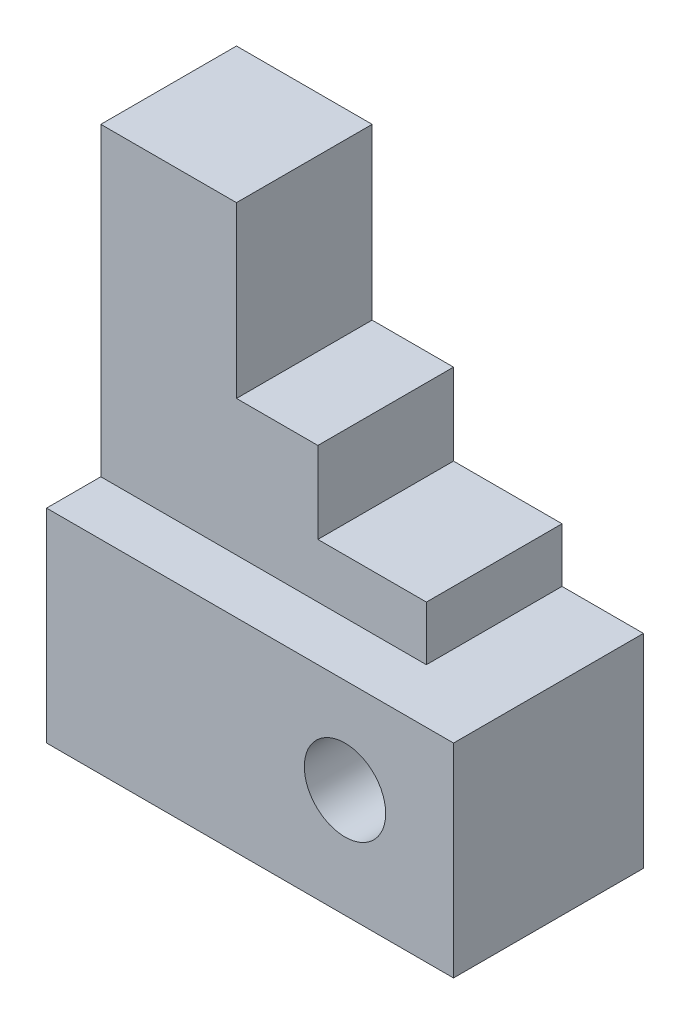
ISO-10303-21;
HEADER;
FILE_DESCRIPTION(('STEP AP214'),'2;1');
FILE_NAME('part.step','',(''),(''),'','','');
FILE_SCHEMA(('AUTOMOTIVE_DESIGN { 1 0 10303 214 1 1 1 1 }'));
ENDSEC;
DATA;
#1=APPLICATION_CONTEXT('core data for automotive mechanical design processes');
#2=APPLICATION_PROTOCOL_DEFINITION('international standard','automotive_design',2000,#1);
#3=PRODUCT_CONTEXT('',#1,'mechanical');
#4=PRODUCT('Part','Part','',(#3));
#5=PRODUCT_RELATED_PRODUCT_CATEGORY('part','',(#4));
#6=PRODUCT_DEFINITION_FORMATION('','',#4);
#7=PRODUCT_DEFINITION_CONTEXT('part definition',#1,'design');
#8=PRODUCT_DEFINITION('design','',#6,#7);
#9=PRODUCT_DEFINITION_SHAPE('','',#8);
#10=(LENGTH_UNIT() NAMED_UNIT(*) SI_UNIT(.MILLI.,.METRE.));
#11=(NAMED_UNIT(*) PLANE_ANGLE_UNIT() SI_UNIT($,.RADIAN.));
#12=(NAMED_UNIT(*) SI_UNIT($,.STERADIAN.) SOLID_ANGLE_UNIT());
#13=UNCERTAINTY_MEASURE_WITH_UNIT(LENGTH_MEASURE(1.E-05),#10,'distance_accuracy_value','');
#14=(GEOMETRIC_REPRESENTATION_CONTEXT(3) GLOBAL_UNCERTAINTY_ASSIGNED_CONTEXT((#13)) GLOBAL_UNIT_ASSIGNED_CONTEXT((#10,
#11,#12)) REPRESENTATION_CONTEXT('',''));
#15=CARTESIAN_POINT('',(0.,0.,0.));
#16=DIRECTION('',(0.,0.,1.));
#17=DIRECTION('',(1.,0.,0.));
#18=AXIS2_PLACEMENT_3D('',#15,#16,#17);
#19=CARTESIAN_POINT('',(0.,15.,28.));
#20=DIRECTION('',(0.,-1.,0.));
#21=DIRECTION('',(1.,0.,0.));
#22=AXIS2_PLACEMENT_3D('',#19,#20,#21);
#23=PLANE('',#22);
#24=DIRECTION('',(0.,0.,-1.));
#25=VECTOR('',#24,1.);
#26=CARTESIAN_POINT('',(18.,15.,20.));
#27=LINE('',#26,#25);
#28=CARTESIAN_POINT('',(18.,15.,20.));
#29=VERTEX_POINT('',#28);
#30=CARTESIAN_POINT('',(18.,15.,0.));
#31=VERTEX_POINT('',#30);
#32=EDGE_CURVE('E125',#29,#31,#27,.T.);
#33=ORIENTED_EDGE('',*,*,#32,.F.);
#34=DIRECTION('',(1.,0.,0.));
#35=VECTOR('',#34,1.);
#36=CARTESIAN_POINT('',(0.,15.,20.));
#37=LINE('',#36,#35);
#38=CARTESIAN_POINT('',(-30.,15.,20.));
#39=VERTEX_POINT('',#38);
#40=EDGE_CURVE('E61',#39,#29,#37,.T.);
#41=ORIENTED_EDGE('',*,*,#40,.F.);
#42=DIRECTION('',(0.,0.,-1.));
#43=VECTOR('',#42,1.);
#44=CARTESIAN_POINT('',(-30.,15.,28.));
#45=LINE('',#44,#43);
#46=CARTESIAN_POINT('',(-30.,15.,28.));
#47=VERTEX_POINT('',#46);
#48=EDGE_CURVE('E229',#47,#39,#45,.T.);
#49=ORIENTED_EDGE('',*,*,#48,.F.);
#50=DIRECTION('',(-1.,0.,0.));
#51=VECTOR('',#50,1.);
#52=CARTESIAN_POINT('',(0.,15.,28.));
#53=LINE('',#52,#51);
#54=CARTESIAN_POINT('',(30.,15.,28.));
#55=VERTEX_POINT('',#54);
#56=EDGE_CURVE('E226',#55,#47,#53,.T.);
#57=ORIENTED_EDGE('',*,*,#56,.F.);
#58=DIRECTION('',(0.,0.,-1.));
#59=VECTOR('',#58,1.);
#60=CARTESIAN_POINT('',(30.,15.,28.));
#61=LINE('',#60,#59);
#62=CARTESIAN_POINT('',(30.,15.,0.));
#63=VERTEX_POINT('',#62);
#64=EDGE_CURVE('E248',#55,#63,#61,.T.);
#65=ORIENTED_EDGE('',*,*,#64,.T.);
#66=DIRECTION('',(-1.,0.,0.));
#67=VECTOR('',#66,1.);
#68=CARTESIAN_POINT('',(0.,15.,0.));
#69=LINE('',#68,#67);
#70=EDGE_CURVE('E67',#63,#31,#69,.T.);
#71=ORIENTED_EDGE('',*,*,#70,.T.);
#72=EDGE_LOOP('',(#33,#41,#49,#57,#65,#71));
#73=FACE_BOUND('',#72,.T.);
#74=ADVANCED_FACE('F45',(#73),#23,.F.);
#75=CARTESIAN_POINT('',(-30.,0.,28.));
#76=DIRECTION('',(-1.,0.,0.));
#77=DIRECTION('',(0.,0.,1.));
#78=AXIS2_PLACEMENT_3D('',#75,#76,#77);
#79=PLANE('',#78);
#80=DIRECTION('',(0.,1.,0.));
#81=VECTOR('',#80,1.);
#82=CARTESIAN_POINT('',(-30.,0.,0.));
#83=LINE('',#82,#81);
#84=CARTESIAN_POINT('',(-30.,-15.,0.));
#85=VERTEX_POINT('',#84);
#86=CARTESIAN_POINT('',(-30.,60.,0.));
#87=VERTEX_POINT('',#86);
#88=EDGE_CURVE('E233',#85,#87,#83,.T.);
#89=ORIENTED_EDGE('',*,*,#88,.F.);
#90=DIRECTION('',(0.,0.,-1.));
#91=VECTOR('',#90,1.);
#92=CARTESIAN_POINT('',(-30.,-15.,28.));
#93=LINE('',#92,#91);
#94=CARTESIAN_POINT('',(-30.,-15.,28.));
#95=VERTEX_POINT('',#94);
#96=EDGE_CURVE('E11',#95,#85,#93,.T.);
#97=ORIENTED_EDGE('',*,*,#96,.F.);
#98=DIRECTION('',(0.,1.,0.));
#99=VECTOR('',#98,1.);
#100=CARTESIAN_POINT('',(-30.,0.,28.));
#101=LINE('',#100,#99);
#102=EDGE_CURVE('E214',#95,#47,#101,.T.);
#103=ORIENTED_EDGE('',*,*,#102,.T.);
#104=ORIENTED_EDGE('',*,*,#48,.T.);
#105=DIRECTION('',(0.,1.,0.));
#106=VECTOR('',#105,1.);
#107=CARTESIAN_POINT('',(-30.,0.,20.));
#108=LINE('',#107,#106);
#109=CARTESIAN_POINT('',(-30.,60.,20.));
#110=VERTEX_POINT('',#109);
#111=EDGE_CURVE('E142',#39,#110,#108,.T.);
#112=ORIENTED_EDGE('',*,*,#111,.T.);
#113=DIRECTION('',(0.,0.,-1.));
#114=VECTOR('',#113,1.);
#115=CARTESIAN_POINT('',(-30.,60.,20.));
#116=LINE('',#115,#114);
#117=EDGE_CURVE('E131',#110,#87,#116,.T.);
#118=ORIENTED_EDGE('',*,*,#117,.T.);
#119=EDGE_LOOP('',(#89,#97,#103,#104,#112,#118));
#120=FACE_BOUND('',#119,.T.);
#121=ADVANCED_FACE('F265',(#120),#79,.T.);
#122=CARTESIAN_POINT('',(0.,-15.,28.));
#123=DIRECTION('',(0.,-1.,0.));
#124=DIRECTION('',(1.,0.,0.));
#125=AXIS2_PLACEMENT_3D('',#122,#123,#124);
#126=PLANE('',#125);
#127=DIRECTION('',(-1.,0.,0.));
#128=VECTOR('',#127,1.);
#129=CARTESIAN_POINT('',(0.,-15.,0.));
#130=LINE('',#129,#128);
#131=CARTESIAN_POINT('',(30.,-15.,0.));
#132=VERTEX_POINT('',#131);
#133=EDGE_CURVE('E236',#132,#85,#130,.T.);
#134=ORIENTED_EDGE('',*,*,#133,.F.);
#135=DIRECTION('',(0.,0.,-1.));
#136=VECTOR('',#135,1.);
#137=CARTESIAN_POINT('',(30.,-15.,28.));
#138=LINE('',#137,#136);
#139=CARTESIAN_POINT('',(30.,-15.,28.));
#140=VERTEX_POINT('',#139);
#141=EDGE_CURVE('E54',#140,#132,#138,.T.);
#142=ORIENTED_EDGE('',*,*,#141,.F.);
#143=DIRECTION('',(-1.,0.,0.));
#144=VECTOR('',#143,1.);
#145=CARTESIAN_POINT('',(0.,-15.,28.));
#146=LINE('',#145,#144);
#147=EDGE_CURVE('E218',#140,#95,#146,.T.);
#148=ORIENTED_EDGE('',*,*,#147,.T.);
#149=ORIENTED_EDGE('',*,*,#96,.T.);
#150=EDGE_LOOP('',(#134,#142,#148,#149));
#151=FACE_BOUND('',#150,.T.);
#152=ADVANCED_FACE('F261',(#151),#126,.T.);
#153=CARTESIAN_POINT('',(30.,0.,28.));
#154=DIRECTION('',(-1.,0.,0.));
#155=DIRECTION('',(0.,-1.,0.));
#156=AXIS2_PLACEMENT_3D('',#153,#154,#155);
#157=PLANE('',#156);
#158=DIRECTION('',(0.,1.,0.));
#159=VECTOR('',#158,1.);
#160=CARTESIAN_POINT('',(30.,0.,0.));
#161=LINE('',#160,#159);
#162=EDGE_CURVE('E240',#132,#63,#161,.T.);
#163=ORIENTED_EDGE('',*,*,#162,.T.);
#164=ORIENTED_EDGE('',*,*,#64,.F.);
#165=DIRECTION('',(0.,1.,0.));
#166=VECTOR('',#165,1.);
#167=CARTESIAN_POINT('',(30.,0.,28.));
#168=LINE('',#167,#166);
#169=EDGE_CURVE('E222',#140,#55,#168,.T.);
#170=ORIENTED_EDGE('',*,*,#169,.F.);
#171=ORIENTED_EDGE('',*,*,#141,.T.);
#172=EDGE_LOOP('',(#163,#164,#170,#171));
#173=FACE_BOUND('',#172,.T.);
#174=ADVANCED_FACE('F254',(#173),#157,.F.);
#175=CARTESIAN_POINT('',(14.,1.,28.));
#176=DIRECTION('',(0.,0.,-1.));
#177=DIRECTION('',(-1.,0.,0.));
#178=AXIS2_PLACEMENT_3D('',#175,#176,#177);
#179=CYLINDRICAL_SURFACE('',#178,6.);
#180=CARTESIAN_POINT('',(14.,1.,28.));
#181=DIRECTION('',(0.,0.,1.));
#182=DIRECTION('',(1.,0.,0.));
#183=AXIS2_PLACEMENT_3D('',#180,#181,#182);
#184=CIRCLE('',#183,6.);
#185=CARTESIAN_POINT('',(20.,1.,28.));
#186=VERTEX_POINT('',#185);
#187=EDGE_CURVE('E210',#186,#186,#184,.T.);
#188=ORIENTED_EDGE('',*,*,#187,.T.);
#189=EDGE_LOOP('',(#188));
#190=FACE_BOUND('',#189,.T.);
#191=CARTESIAN_POINT('',(14.,1.,0.));
#192=DIRECTION('',(0.,0.,1.));
#193=DIRECTION('',(1.,0.,0.));
#194=AXIS2_PLACEMENT_3D('',#191,#192,#193);
#195=CIRCLE('',#194,6.);
#196=CARTESIAN_POINT('',(20.,1.,0.));
#197=VERTEX_POINT('',#196);
#198=EDGE_CURVE('E194',#197,#197,#195,.T.);
#199=ORIENTED_EDGE('',*,*,#198,.F.);
#200=EDGE_LOOP('',(#199));
#201=FACE_BOUND('',#200,.T.);
#202=ADVANCED_FACE('F47',(#190,#201),#179,.F.);
#203=CARTESIAN_POINT('',(0.,0.,28.));
#204=DIRECTION('',(0.,0.,1.));
#205=DIRECTION('',(1.,0.,0.));
#206=AXIS2_PLACEMENT_3D('',#203,#204,#205);
#207=PLANE('',#206);
#208=ORIENTED_EDGE('',*,*,#187,.F.);
#209=EDGE_LOOP('',(#208));
#210=FACE_BOUND('',#209,.T.);
#211=ORIENTED_EDGE('',*,*,#102,.F.);
#212=ORIENTED_EDGE('',*,*,#147,.F.);
#213=ORIENTED_EDGE('',*,*,#169,.T.);
#214=ORIENTED_EDGE('',*,*,#56,.T.);
#215=EDGE_LOOP('',(#211,#212,#213,#214));
#216=FACE_BOUND('',#215,.T.);
#217=ADVANCED_FACE('F319',(#210,#216),#207,.T.);
#218=CARTESIAN_POINT('',(0.,0.,0.));
#219=DIRECTION('',(0.,0.,1.));
#220=DIRECTION('',(1.,0.,0.));
#221=AXIS2_PLACEMENT_3D('',#218,#219,#220);
#222=PLANE('',#221);
#223=ORIENTED_EDGE('',*,*,#198,.T.);
#224=EDGE_LOOP('',(#223));
#225=FACE_BOUND('',#224,.T.);
#226=ORIENTED_EDGE('',*,*,#88,.T.);
#227=DIRECTION('',(1.,0.,0.));
#228=VECTOR('',#227,1.);
#229=CARTESIAN_POINT('',(0.,60.,0.));
#230=LINE('',#229,#228);
#231=CARTESIAN_POINT('',(-9.99999999999999,60.,0.));
#232=VERTEX_POINT('',#231);
#233=EDGE_CURVE('E177',#87,#232,#230,.T.);
#234=ORIENTED_EDGE('',*,*,#233,.T.);
#235=DIRECTION('',(0.,1.,0.));
#236=VECTOR('',#235,1.);
#237=CARTESIAN_POINT('',(-9.99999999999999,0.,0.));
#238=LINE('',#237,#236);
#239=CARTESIAN_POINT('',(-9.99999999999999,35.,0.));
#240=VERTEX_POINT('',#239);
#241=EDGE_CURVE('E181',#240,#232,#238,.T.);
#242=ORIENTED_EDGE('',*,*,#241,.F.);
#243=DIRECTION('',(1.,0.,0.));
#244=VECTOR('',#243,1.);
#245=CARTESIAN_POINT('',(0.,35.,0.));
#246=LINE('',#245,#244);
#247=CARTESIAN_POINT('',(2.00000000000001,35.,0.));
#248=VERTEX_POINT('',#247);
#249=EDGE_CURVE('E185',#240,#248,#246,.T.);
#250=ORIENTED_EDGE('',*,*,#249,.T.);
#251=DIRECTION('',(0.,1.,0.));
#252=VECTOR('',#251,1.);
#253=CARTESIAN_POINT('',(2.00000000000001,0.,0.));
#254=LINE('',#253,#252);
#255=CARTESIAN_POINT('',(2.00000000000001,23.,0.));
#256=VERTEX_POINT('',#255);
#257=EDGE_CURVE('E153',#256,#248,#254,.T.);
#258=ORIENTED_EDGE('',*,*,#257,.F.);
#259=DIRECTION('',(1.,0.,0.));
#260=VECTOR('',#259,1.);
#261=CARTESIAN_POINT('',(0.,23.,0.));
#262=LINE('',#261,#260);
#263=CARTESIAN_POINT('',(18.,23.,0.));
#264=VERTEX_POINT('',#263);
#265=EDGE_CURVE('E149',#256,#264,#262,.T.);
#266=ORIENTED_EDGE('',*,*,#265,.T.);
#267=DIRECTION('',(0.,1.,0.));
#268=VECTOR('',#267,1.);
#269=CARTESIAN_POINT('',(18.,0.,0.));
#270=LINE('',#269,#268);
#271=EDGE_CURVE('E174',#31,#264,#270,.T.);
#272=ORIENTED_EDGE('',*,*,#271,.F.);
#273=ORIENTED_EDGE('',*,*,#70,.F.);
#274=ORIENTED_EDGE('',*,*,#162,.F.);
#275=ORIENTED_EDGE('',*,*,#133,.T.);
#276=EDGE_LOOP('',(#226,#234,#242,#250,#258,#266,#272,#273,#274,#275));
#277=FACE_BOUND('',#276,.T.);
#278=ADVANCED_FACE('F260',(#225,#277),#222,.F.);
#279=CARTESIAN_POINT('',(18.,0.,20.));
#280=DIRECTION('',(-1.,0.,0.));
#281=DIRECTION('',(0.,0.,1.));
#282=AXIS2_PLACEMENT_3D('',#279,#280,#281);
#283=PLANE('',#282);
#284=ORIENTED_EDGE('',*,*,#271,.T.);
#285=DIRECTION('',(0.,0.,-1.));
#286=VECTOR('',#285,1.);
#287=CARTESIAN_POINT('',(18.,23.,20.));
#288=LINE('',#287,#286);
#289=CARTESIAN_POINT('',(18.,23.,20.));
#290=VERTEX_POINT('',#289);
#291=EDGE_CURVE('E146',#290,#264,#288,.T.);
#292=ORIENTED_EDGE('',*,*,#291,.F.);
#293=DIRECTION('',(0.,1.,0.));
#294=VECTOR('',#293,1.);
#295=CARTESIAN_POINT('',(18.,0.,20.));
#296=LINE('',#295,#294);
#297=EDGE_CURVE('E138',#29,#290,#296,.T.);
#298=ORIENTED_EDGE('',*,*,#297,.F.);
#299=ORIENTED_EDGE('',*,*,#32,.T.);
#300=EDGE_LOOP('',(#284,#292,#298,#299));
#301=FACE_BOUND('',#300,.T.);
#302=ADVANCED_FACE('F145',(#301),#283,.F.);
#303=CARTESIAN_POINT('',(0.,23.,20.));
#304=DIRECTION('',(0.,1.,0.));
#305=DIRECTION('',(-1.,0.,0.));
#306=AXIS2_PLACEMENT_3D('',#303,#304,#305);
#307=PLANE('',#306);
#308=ORIENTED_EDGE('',*,*,#265,.F.);
#309=DIRECTION('',(0.,0.,-1.));
#310=VECTOR('',#309,1.);
#311=CARTESIAN_POINT('',(2.00000000000001,23.,20.));
#312=LINE('',#311,#310);
#313=CARTESIAN_POINT('',(2.00000000000001,23.,20.));
#314=VERTEX_POINT('',#313);
#315=EDGE_CURVE('E195',#314,#256,#312,.T.);
#316=ORIENTED_EDGE('',*,*,#315,.F.);
#317=DIRECTION('',(1.,0.,0.));
#318=VECTOR('',#317,1.);
#319=CARTESIAN_POINT('',(0.,23.,20.));
#320=LINE('',#319,#318);
#321=EDGE_CURVE('E132',#314,#290,#320,.T.);
#322=ORIENTED_EDGE('',*,*,#321,.T.);
#323=ORIENTED_EDGE('',*,*,#291,.T.);
#324=EDGE_LOOP('',(#308,#316,#322,#323));
#325=FACE_BOUND('',#324,.T.);
#326=ADVANCED_FACE('F283',(#325),#307,.T.);
#327=CARTESIAN_POINT('',(2.00000000000001,0.,20.));
#328=DIRECTION('',(-1.,0.,0.));
#329=DIRECTION('',(0.,0.,1.));
#330=AXIS2_PLACEMENT_3D('',#327,#328,#329);
#331=PLANE('',#330);
#332=ORIENTED_EDGE('',*,*,#257,.T.);
#333=DIRECTION('',(0.,0.,-1.));
#334=VECTOR('',#333,1.);
#335=CARTESIAN_POINT('',(2.00000000000001,35.,20.));
#336=LINE('',#335,#334);
#337=CARTESIAN_POINT('',(2.00000000000001,35.,20.));
#338=VERTEX_POINT('',#337);
#339=EDGE_CURVE('E198',#338,#248,#336,.T.);
#340=ORIENTED_EDGE('',*,*,#339,.F.);
#341=DIRECTION('',(0.,1.,0.));
#342=VECTOR('',#341,1.);
#343=CARTESIAN_POINT('',(2.00000000000001,0.,20.));
#344=LINE('',#343,#342);
#345=EDGE_CURVE('E169',#314,#338,#344,.T.);
#346=ORIENTED_EDGE('',*,*,#345,.F.);
#347=ORIENTED_EDGE('',*,*,#315,.T.);
#348=EDGE_LOOP('',(#332,#340,#346,#347));
#349=FACE_BOUND('',#348,.T.);
#350=ADVANCED_FACE('F285',(#349),#331,.F.);
#351=CARTESIAN_POINT('',(0.,35.,20.));
#352=DIRECTION('',(0.,1.,0.));
#353=DIRECTION('',(0.,0.,1.));
#354=AXIS2_PLACEMENT_3D('',#351,#352,#353);
#355=PLANE('',#354);
#356=ORIENTED_EDGE('',*,*,#249,.F.);
#357=DIRECTION('',(0.,0.,-1.));
#358=VECTOR('',#357,1.);
#359=CARTESIAN_POINT('',(-9.99999999999999,35.,20.));
#360=LINE('',#359,#358);
#361=CARTESIAN_POINT('',(-9.99999999999999,35.,20.));
#362=VERTEX_POINT('',#361);
#363=EDGE_CURVE('E201',#362,#240,#360,.T.);
#364=ORIENTED_EDGE('',*,*,#363,.F.);
#365=DIRECTION('',(1.,0.,0.));
#366=VECTOR('',#365,1.);
#367=CARTESIAN_POINT('',(0.,35.,20.));
#368=LINE('',#367,#366);
#369=EDGE_CURVE('E165',#362,#338,#368,.T.);
#370=ORIENTED_EDGE('',*,*,#369,.T.);
#371=ORIENTED_EDGE('',*,*,#339,.T.);
#372=EDGE_LOOP('',(#356,#364,#370,#371));
#373=FACE_BOUND('',#372,.T.);
#374=ADVANCED_FACE('F277',(#373),#355,.T.);
#375=CARTESIAN_POINT('',(-9.99999999999999,0.,20.));
#376=DIRECTION('',(-1.,0.,0.));
#377=DIRECTION('',(0.,0.,1.));
#378=AXIS2_PLACEMENT_3D('',#375,#376,#377);
#379=PLANE('',#378);
#380=ORIENTED_EDGE('',*,*,#241,.T.);
#381=DIRECTION('',(0.,0.,-1.));
#382=VECTOR('',#381,1.);
#383=CARTESIAN_POINT('',(-9.99999999999999,60.,20.));
#384=LINE('',#383,#382);
#385=CARTESIAN_POINT('',(-9.99999999999999,60.,20.));
#386=VERTEX_POINT('',#385);
#387=EDGE_CURVE('E204',#386,#232,#384,.T.);
#388=ORIENTED_EDGE('',*,*,#387,.F.);
#389=DIRECTION('',(0.,1.,0.));
#390=VECTOR('',#389,1.);
#391=CARTESIAN_POINT('',(-9.99999999999999,0.,20.));
#392=LINE('',#391,#390);
#393=EDGE_CURVE('E162',#362,#386,#392,.T.);
#394=ORIENTED_EDGE('',*,*,#393,.F.);
#395=ORIENTED_EDGE('',*,*,#363,.T.);
#396=EDGE_LOOP('',(#380,#388,#394,#395));
#397=FACE_BOUND('',#396,.T.);
#398=ADVANCED_FACE('F274',(#397),#379,.F.);
#399=CARTESIAN_POINT('',(0.,60.,20.));
#400=DIRECTION('',(0.,1.,0.));
#401=DIRECTION('',(0.,0.,1.));
#402=AXIS2_PLACEMENT_3D('',#399,#400,#401);
#403=PLANE('',#402);
#404=ORIENTED_EDGE('',*,*,#233,.F.);
#405=ORIENTED_EDGE('',*,*,#117,.F.);
#406=DIRECTION('',(1.,0.,0.));
#407=VECTOR('',#406,1.);
#408=CARTESIAN_POINT('',(0.,60.,20.));
#409=LINE('',#408,#407);
#410=EDGE_CURVE('E158',#110,#386,#409,.T.);
#411=ORIENTED_EDGE('',*,*,#410,.T.);
#412=ORIENTED_EDGE('',*,*,#387,.T.);
#413=EDGE_LOOP('',(#404,#405,#411,#412));
#414=FACE_BOUND('',#413,.T.);
#415=ADVANCED_FACE('F270',(#414),#403,.T.);
#416=CARTESIAN_POINT('',(0.,0.,20.));
#417=DIRECTION('',(0.,0.,-1.));
#418=DIRECTION('',(-1.,0.,0.));
#419=AXIS2_PLACEMENT_3D('',#416,#417,#418);
#420=PLANE('',#419);
#421=ORIENTED_EDGE('',*,*,#297,.T.);
#422=ORIENTED_EDGE('',*,*,#321,.F.);
#423=ORIENTED_EDGE('',*,*,#345,.T.);
#424=ORIENTED_EDGE('',*,*,#369,.F.);
#425=ORIENTED_EDGE('',*,*,#393,.T.);
#426=ORIENTED_EDGE('',*,*,#410,.F.);
#427=ORIENTED_EDGE('',*,*,#111,.F.);
#428=ORIENTED_EDGE('',*,*,#40,.T.);
#429=EDGE_LOOP('',(#421,#422,#423,#424,#425,#426,#427,#428));
#430=FACE_BOUND('',#429,.T.);
#431=ADVANCED_FACE('F136',(#430),#420,.F.);
#432=CLOSED_SHELL('',(#74,#121,#152,#174,#202,#217,#278,#302,#326,#350,#374,#398,#415,#431));
#433=MANIFOLD_SOLID_BREP('B2',#432);
#434=ADVANCED_BREP_SHAPE_REPRESENTATION('',(#18,#433),#14);
#435=SHAPE_DEFINITION_REPRESENTATION(#9,#434);
ENDSEC;
END-ISO-10303-21;
